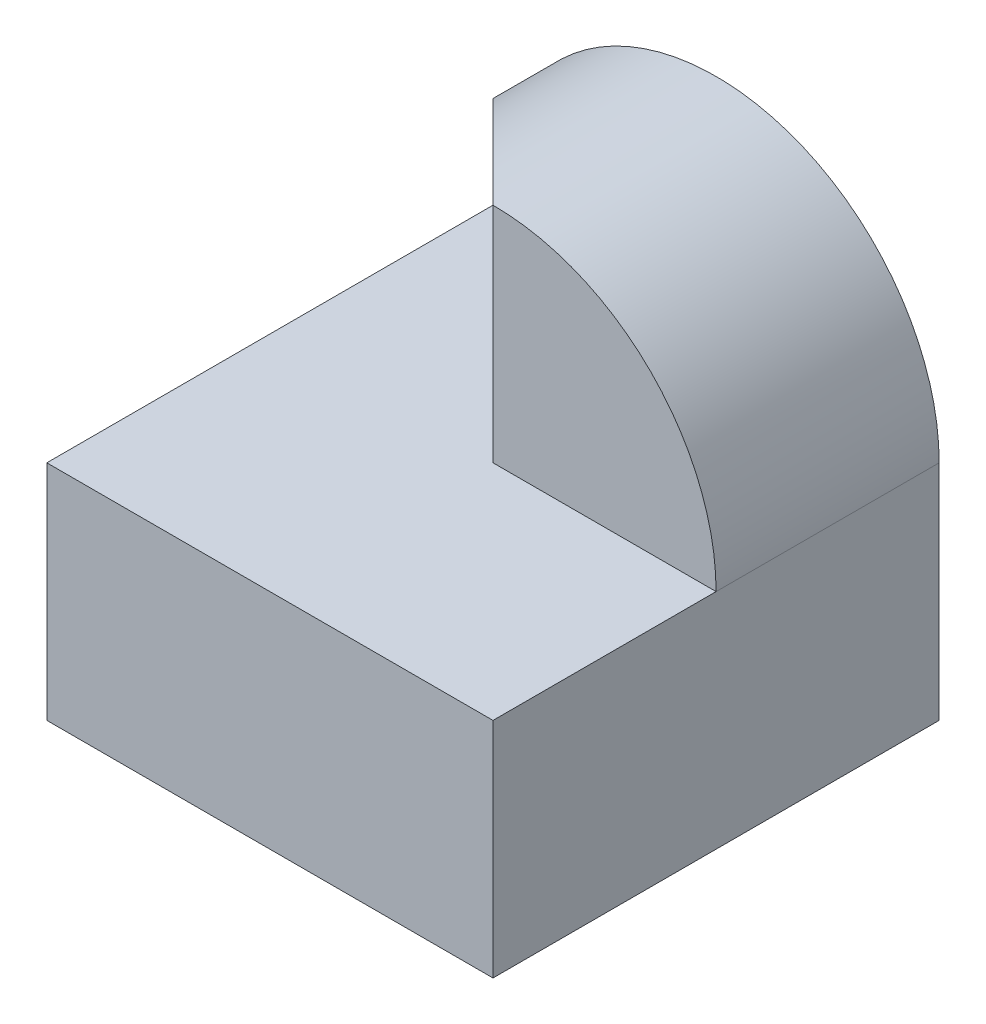
ISO-10303-21;
HEADER;
FILE_DESCRIPTION(('STEP AP214'),'2;1');
FILE_NAME('part.step','',(''),(''),'','','');
FILE_SCHEMA(('AUTOMOTIVE_DESIGN { 1 0 10303 214 1 1 1 1 }'));
ENDSEC;
DATA;
#1=APPLICATION_CONTEXT('core data for automotive mechanical design processes');
#2=APPLICATION_PROTOCOL_DEFINITION('international standard','automotive_design',2000,#1);
#3=PRODUCT_CONTEXT('',#1,'mechanical');
#4=PRODUCT('Part','Part','',(#3));
#5=PRODUCT_RELATED_PRODUCT_CATEGORY('part','',(#4));
#6=PRODUCT_DEFINITION_FORMATION('','',#4);
#7=PRODUCT_DEFINITION_CONTEXT('part definition',#1,'design');
#8=PRODUCT_DEFINITION('design','',#6,#7);
#9=PRODUCT_DEFINITION_SHAPE('','',#8);
#10=(LENGTH_UNIT() NAMED_UNIT(*) SI_UNIT(.MILLI.,.METRE.));
#11=(NAMED_UNIT(*) PLANE_ANGLE_UNIT() SI_UNIT($,.RADIAN.));
#12=(NAMED_UNIT(*) SI_UNIT($,.STERADIAN.) SOLID_ANGLE_UNIT());
#13=UNCERTAINTY_MEASURE_WITH_UNIT(LENGTH_MEASURE(1.E-05),#10,'distance_accuracy_value','');
#14=(GEOMETRIC_REPRESENTATION_CONTEXT(3) GLOBAL_UNCERTAINTY_ASSIGNED_CONTEXT((#13)) GLOBAL_UNIT_ASSIGNED_CONTEXT((#10,
#11,#12)) REPRESENTATION_CONTEXT('',''));
#15=CARTESIAN_POINT('',(0.,0.,0.));
#16=DIRECTION('',(0.,0.,1.));
#17=DIRECTION('',(1.,0.,0.));
#18=AXIS2_PLACEMENT_3D('',#15,#16,#17);
#19=CARTESIAN_POINT('',(0.,0.,0.));
#20=DIRECTION('',(0.,0.,1.));
#21=DIRECTION('',(1.,0.,0.));
#22=AXIS2_PLACEMENT_3D('',#19,#20,#21);
#23=PLANE('',#22);
#24=CARTESIAN_POINT('',(0.,2.,0.));
#25=DIRECTION('',(0.,0.,1.));
#26=DIRECTION('',(1.,0.,0.));
#27=AXIS2_PLACEMENT_3D('',#24,#25,#26);
#28=CIRCLE('',#27,2.);
#29=CARTESIAN_POINT('',(0.,4.,0.));
#30=VERTEX_POINT('',#29);
#31=CARTESIAN_POINT('',(2.,2.,0.));
#32=VERTEX_POINT('',#31);
#33=EDGE_CURVE('E126',#30,#32,#28,.F.);
#34=ORIENTED_EDGE('',*,*,#33,.F.);
#35=DIRECTION('',(0.,-1.,0.));
#36=VECTOR('',#35,1.);
#37=CARTESIAN_POINT('',(0.,4.,0.));
#38=LINE('',#37,#36);
#39=CARTESIAN_POINT('',(0.,2.,0.));
#40=VERTEX_POINT('',#39);
#41=EDGE_CURVE('E112',#30,#40,#38,.T.);
#42=ORIENTED_EDGE('',*,*,#41,.T.);
#43=DIRECTION('',(1.,0.,0.));
#44=VECTOR('',#43,1.);
#45=CARTESIAN_POINT('',(-2.,2.,0.));
#46=LINE('',#45,#44);
#47=EDGE_CURVE('E130',#40,#32,#46,.T.);
#48=ORIENTED_EDGE('',*,*,#47,.T.);
#49=EDGE_LOOP('',(#34,#42,#48));
#50=FACE_BOUND('',#49,.T.);
#51=ADVANCED_FACE('F51',(#50),#23,.T.);
#52=CARTESIAN_POINT('',(0.,2.,-2.));
#53=DIRECTION('',(0.,0.,1.));
#54=DIRECTION('',(1.,0.,0.));
#55=AXIS2_PLACEMENT_3D('',#52,#53,#54);
#56=CYLINDRICAL_SURFACE('',#55,2.);
#57=CARTESIAN_POINT('',(0.,2.,0.));
#58=DIRECTION('',(-0.707106781186547,0.,0.707106781186548));
#59=DIRECTION('',(0.707106781186548,0.,0.707106781186547));
#60=AXIS2_PLACEMENT_3D('',#57,#58,#59);
#61=ELLIPSE('',#60,2.82842712474619,2.);
#62=CARTESIAN_POINT('',(-2.,2.,-2.));
#63=VERTEX_POINT('',#62);
#64=EDGE_CURVE('E12',#30,#63,#61,.T.);
#65=ORIENTED_EDGE('',*,*,#64,.F.);
#66=ORIENTED_EDGE('',*,*,#33,.T.);
#67=DIRECTION('',(0.,0.,1.));
#68=VECTOR('',#67,1.);
#69=CARTESIAN_POINT('',(2.,2.,-2.));
#70=LINE('',#69,#68);
#71=CARTESIAN_POINT('',(2.,2.,-2.));
#72=VERTEX_POINT('',#71);
#73=EDGE_CURVE('E120',#72,#32,#70,.T.);
#74=ORIENTED_EDGE('',*,*,#73,.F.);
#75=CARTESIAN_POINT('',(0.,2.,-2.));
#76=DIRECTION('',(0.,0.,1.));
#77=DIRECTION('',(1.,0.,0.));
#78=AXIS2_PLACEMENT_3D('',#75,#76,#77);
#79=CIRCLE('',#78,2.);
#80=EDGE_CURVE('E128',#63,#72,#79,.F.);
#81=ORIENTED_EDGE('',*,*,#80,.F.);
#82=EDGE_LOOP('',(#65,#66,#74,#81));
#83=FACE_BOUND('',#82,.T.);
#84=ADVANCED_FACE('F124',(#83),#56,.T.);
#85=CARTESIAN_POINT('',(-2.,4.,-2.));
#86=DIRECTION('',(0.,0.,1.));
#87=DIRECTION('',(1.,0.,0.));
#88=AXIS2_PLACEMENT_3D('',#85,#86,#87);
#89=PLANE('',#88);
#90=ORIENTED_EDGE('',*,*,#80,.T.);
#91=DIRECTION('',(0.,-1.,0.));
#92=VECTOR('',#91,1.);
#93=CARTESIAN_POINT('',(2.,4.,-2.));
#94=LINE('',#93,#92);
#95=CARTESIAN_POINT('',(2.,0.,-2.));
#96=VERTEX_POINT('',#95);
#97=EDGE_CURVE('E59',#72,#96,#94,.T.);
#98=ORIENTED_EDGE('',*,*,#97,.T.);
#99=DIRECTION('',(-1.,0.,0.));
#100=VECTOR('',#99,1.);
#101=CARTESIAN_POINT('',(-2.,0.,-2.));
#102=LINE('',#101,#100);
#103=CARTESIAN_POINT('',(0.,0.,-2.));
#104=VERTEX_POINT('',#103);
#105=EDGE_CURVE('E156',#96,#104,#102,.T.);
#106=ORIENTED_EDGE('',*,*,#105,.T.);
#107=DIRECTION('',(0.707106781186548,-0.707106781186548,0.));
#108=VECTOR('',#107,1.);
#109=CARTESIAN_POINT('',(-2.,2.,-2.));
#110=LINE('',#109,#108);
#111=EDGE_CURVE('E132',#63,#104,#110,.T.);
#112=ORIENTED_EDGE('',*,*,#111,.F.);
#113=EDGE_LOOP('',(#90,#98,#106,#112));
#114=FACE_BOUND('',#113,.T.);
#115=ADVANCED_FACE('F169',(#114),#89,.F.);
#116=CARTESIAN_POINT('',(2.,4.,2.));
#117=DIRECTION('',(-1.,0.,0.));
#118=DIRECTION('',(0.,0.,1.));
#119=AXIS2_PLACEMENT_3D('',#116,#117,#118);
#120=PLANE('',#119);
#121=ORIENTED_EDGE('',*,*,#73,.T.);
#122=DIRECTION('',(0.,0.,1.));
#123=VECTOR('',#122,1.);
#124=CARTESIAN_POINT('',(2.,2.,0.));
#125=LINE('',#124,#123);
#126=CARTESIAN_POINT('',(2.,2.,2.));
#127=VERTEX_POINT('',#126);
#128=EDGE_CURVE('E151',#32,#127,#125,.T.);
#129=ORIENTED_EDGE('',*,*,#128,.T.);
#130=DIRECTION('',(0.,-1.,0.));
#131=VECTOR('',#130,1.);
#132=CARTESIAN_POINT('',(2.,4.,2.));
#133=LINE('',#132,#131);
#134=CARTESIAN_POINT('',(2.,0.,2.));
#135=VERTEX_POINT('',#134);
#136=EDGE_CURVE('E74',#127,#135,#133,.T.);
#137=ORIENTED_EDGE('',*,*,#136,.T.);
#138=DIRECTION('',(0.,0.,-1.));
#139=VECTOR('',#138,1.);
#140=CARTESIAN_POINT('',(2.,0.,2.));
#141=LINE('',#140,#139);
#142=EDGE_CURVE('E153',#135,#96,#141,.T.);
#143=ORIENTED_EDGE('',*,*,#142,.T.);
#144=ORIENTED_EDGE('',*,*,#97,.F.);
#145=EDGE_LOOP('',(#121,#129,#137,#143,#144));
#146=FACE_BOUND('',#145,.T.);
#147=ADVANCED_FACE('F53',(#146),#120,.F.);
#148=CARTESIAN_POINT('',(-2.,4.,2.));
#149=DIRECTION('',(1.,0.,0.));
#150=DIRECTION('',(0.,0.,-1.));
#151=AXIS2_PLACEMENT_3D('',#148,#149,#150);
#152=PLANE('',#151);
#153=DIRECTION('',(0.,0.,1.));
#154=VECTOR('',#153,1.);
#155=CARTESIAN_POINT('',(-2.,2.,0.));
#156=LINE('',#155,#154);
#157=CARTESIAN_POINT('',(-2.,2.,0.));
#158=VERTEX_POINT('',#157);
#159=CARTESIAN_POINT('',(-2.,2.,2.));
#160=VERTEX_POINT('',#159);
#161=EDGE_CURVE('E149',#158,#160,#156,.T.);
#162=ORIENTED_EDGE('',*,*,#161,.F.);
#163=DIRECTION('',(0.,1.,0.));
#164=VECTOR('',#163,1.);
#165=CARTESIAN_POINT('',(-2.,0.,0.));
#166=LINE('',#165,#164);
#167=CARTESIAN_POINT('',(-2.,0.,0.));
#168=VERTEX_POINT('',#167);
#169=EDGE_CURVE('E136',#168,#158,#166,.T.);
#170=ORIENTED_EDGE('',*,*,#169,.F.);
#171=DIRECTION('',(0.,0.,1.));
#172=VECTOR('',#171,1.);
#173=CARTESIAN_POINT('',(-2.,0.,2.));
#174=LINE('',#173,#172);
#175=CARTESIAN_POINT('',(-2.,0.,2.));
#176=VERTEX_POINT('',#175);
#177=EDGE_CURVE('E159',#168,#176,#174,.T.);
#178=ORIENTED_EDGE('',*,*,#177,.T.);
#179=DIRECTION('',(0.,-1.,0.));
#180=VECTOR('',#179,1.);
#181=CARTESIAN_POINT('',(-2.,4.,2.));
#182=LINE('',#181,#180);
#183=EDGE_CURVE('E164',#160,#176,#182,.T.);
#184=ORIENTED_EDGE('',*,*,#183,.F.);
#185=EDGE_LOOP('',(#162,#170,#178,#184));
#186=FACE_BOUND('',#185,.T.);
#187=ADVANCED_FACE('F178',(#186),#152,.F.);
#188=CARTESIAN_POINT('',(-2.,4.,2.));
#189=DIRECTION('',(0.,0.,-1.));
#190=DIRECTION('',(-1.,0.,0.));
#191=AXIS2_PLACEMENT_3D('',#188,#189,#190);
#192=PLANE('',#191);
#193=ORIENTED_EDGE('',*,*,#136,.F.);
#194=DIRECTION('',(1.,0.,0.));
#195=VECTOR('',#194,1.);
#196=CARTESIAN_POINT('',(-2.,2.,2.));
#197=LINE('',#196,#195);
#198=EDGE_CURVE('E146',#160,#127,#197,.T.);
#199=ORIENTED_EDGE('',*,*,#198,.F.);
#200=ORIENTED_EDGE('',*,*,#183,.T.);
#201=DIRECTION('',(1.,0.,0.));
#202=VECTOR('',#201,1.);
#203=CARTESIAN_POINT('',(-2.,0.,2.));
#204=LINE('',#203,#202);
#205=EDGE_CURVE('E161',#176,#135,#204,.T.);
#206=ORIENTED_EDGE('',*,*,#205,.T.);
#207=EDGE_LOOP('',(#193,#199,#200,#206));
#208=FACE_BOUND('',#207,.T.);
#209=ADVANCED_FACE('F183',(#208),#192,.F.);
#210=CARTESIAN_POINT('',(0.,0.,0.));
#211=DIRECTION('',(0.,-1.,0.));
#212=DIRECTION('',(0.,0.,-1.));
#213=AXIS2_PLACEMENT_3D('',#210,#211,#212);
#214=PLANE('',#213);
#215=DIRECTION('',(0.,0.,-1.));
#216=VECTOR('',#215,1.);
#217=CARTESIAN_POINT('',(0.,0.,0.));
#218=LINE('',#217,#216);
#219=CARTESIAN_POINT('',(0.,0.,0.));
#220=VERTEX_POINT('',#219);
#221=EDGE_CURVE('E143',#220,#104,#218,.T.);
#222=ORIENTED_EDGE('',*,*,#221,.T.);
#223=ORIENTED_EDGE('',*,*,#105,.F.);
#224=ORIENTED_EDGE('',*,*,#142,.F.);
#225=ORIENTED_EDGE('',*,*,#205,.F.);
#226=ORIENTED_EDGE('',*,*,#177,.F.);
#227=DIRECTION('',(-1.,0.,0.));
#228=VECTOR('',#227,1.);
#229=CARTESIAN_POINT('',(0.,0.,0.));
#230=LINE('',#229,#228);
#231=EDGE_CURVE('E139',#220,#168,#230,.T.);
#232=ORIENTED_EDGE('',*,*,#231,.F.);
#233=EDGE_LOOP('',(#222,#223,#224,#225,#226,#232));
#234=FACE_BOUND('',#233,.T.);
#235=ADVANCED_FACE('F173',(#234),#214,.T.);
#236=CARTESIAN_POINT('',(-2.,2.,0.));
#237=DIRECTION('',(0.,-1.,0.));
#238=DIRECTION('',(0.,0.,-1.));
#239=AXIS2_PLACEMENT_3D('',#236,#237,#238);
#240=PLANE('',#239);
#241=ORIENTED_EDGE('',*,*,#198,.T.);
#242=ORIENTED_EDGE('',*,*,#128,.F.);
#243=ORIENTED_EDGE('',*,*,#47,.F.);
#244=DIRECTION('',(-0.707106781186548,0.,-0.707106781186548));
#245=VECTOR('',#244,1.);
#246=CARTESIAN_POINT('',(0.,2.,0.));
#247=LINE('',#246,#245);
#248=EDGE_CURVE('E116',#40,#63,#247,.T.);
#249=ORIENTED_EDGE('',*,*,#248,.T.);
#250=DIRECTION('',(0.,0.,-1.));
#251=VECTOR('',#250,1.);
#252=CARTESIAN_POINT('',(-2.,2.,0.));
#253=LINE('',#252,#251);
#254=EDGE_CURVE('E141',#158,#63,#253,.T.);
#255=ORIENTED_EDGE('',*,*,#254,.F.);
#256=ORIENTED_EDGE('',*,*,#161,.T.);
#257=EDGE_LOOP('',(#241,#242,#243,#249,#255,#256));
#258=FACE_BOUND('',#257,.T.);
#259=ADVANCED_FACE('F196',(#258),#240,.F.);
#260=CARTESIAN_POINT('',(-2.,2.,0.));
#261=DIRECTION('',(0.707106781186547,0.707106781186547,0.));
#262=DIRECTION('',(-0.707106781186548,0.707106781186548,0.));
#263=AXIS2_PLACEMENT_3D('',#260,#261,#262);
#264=PLANE('',#263);
#265=ORIENTED_EDGE('',*,*,#111,.T.);
#266=ORIENTED_EDGE('',*,*,#221,.F.);
#267=DIRECTION('',(0.707106781186548,-0.707106781186548,0.));
#268=VECTOR('',#267,1.);
#269=CARTESIAN_POINT('',(-2.,2.,0.));
#270=LINE('',#269,#268);
#271=EDGE_CURVE('E66',#158,#220,#270,.T.);
#272=ORIENTED_EDGE('',*,*,#271,.F.);
#273=ORIENTED_EDGE('',*,*,#254,.T.);
#274=EDGE_LOOP('',(#265,#266,#272,#273));
#275=FACE_BOUND('',#274,.T.);
#276=ADVANCED_FACE('F194',(#275),#264,.F.);
#277=CARTESIAN_POINT('',(0.,0.,0.));
#278=DIRECTION('',(0.,0.,1.));
#279=DIRECTION('',(1.,0.,0.));
#280=AXIS2_PLACEMENT_3D('',#277,#278,#279);
#281=PLANE('',#280);
#282=ORIENTED_EDGE('',*,*,#169,.T.);
#283=ORIENTED_EDGE('',*,*,#271,.T.);
#284=ORIENTED_EDGE('',*,*,#231,.T.);
#285=EDGE_LOOP('',(#282,#283,#284));
#286=FACE_BOUND('',#285,.T.);
#287=ADVANCED_FACE('F211',(#286),#281,.F.);
#288=CARTESIAN_POINT('',(0.,4.,0.));
#289=DIRECTION('',(-0.707106781186547,0.,0.707106781186548));
#290=DIRECTION('',(0.707106781186548,0.,0.707106781186547));
#291=AXIS2_PLACEMENT_3D('',#288,#289,#290);
#292=PLANE('',#291);
#293=ORIENTED_EDGE('',*,*,#64,.T.);
#294=ORIENTED_EDGE('',*,*,#248,.F.);
#295=ORIENTED_EDGE('',*,*,#41,.F.);
#296=EDGE_LOOP('',(#293,#294,#295));
#297=FACE_BOUND('',#296,.T.);
#298=ADVANCED_FACE('F114',(#297),#292,.T.);
#299=CLOSED_SHELL('',(#51,#84,#115,#147,#187,#209,#235,#259,#276,#287,#298));
#300=MANIFOLD_SOLID_BREP('B2',#299);
#301=ADVANCED_BREP_SHAPE_REPRESENTATION('',(#18,#300),#14);
#302=SHAPE_DEFINITION_REPRESENTATION(#9,#301);
ENDSEC;
END-ISO-10303-21;
